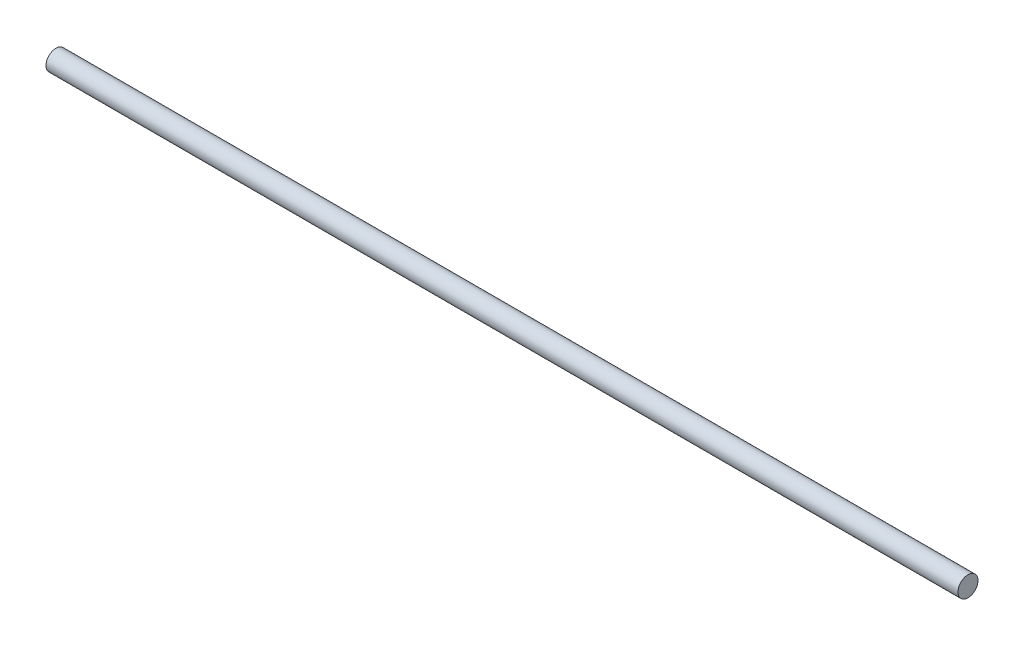
ISO-10303-21;
HEADER;
FILE_DESCRIPTION(('STEP AP214'),'2;1');
FILE_NAME('part.step','',(''),(''),'','','');
FILE_SCHEMA(('AUTOMOTIVE_DESIGN { 1 0 10303 214 1 1 1 1 }'));
ENDSEC;
DATA;
#1=APPLICATION_CONTEXT('core data for automotive mechanical design processes');
#2=APPLICATION_PROTOCOL_DEFINITION('international standard','automotive_design',2000,#1);
#3=PRODUCT_CONTEXT('',#1,'mechanical');
#4=PRODUCT('Part','Part','',(#3));
#5=PRODUCT_RELATED_PRODUCT_CATEGORY('part','',(#4));
#6=PRODUCT_DEFINITION_FORMATION('','',#4);
#7=PRODUCT_DEFINITION_CONTEXT('part definition',#1,'design');
#8=PRODUCT_DEFINITION('design','',#6,#7);
#9=PRODUCT_DEFINITION_SHAPE('','',#8);
#10=(LENGTH_UNIT() NAMED_UNIT(*) SI_UNIT(.MILLI.,.METRE.));
#11=(NAMED_UNIT(*) PLANE_ANGLE_UNIT() SI_UNIT($,.RADIAN.));
#12=(NAMED_UNIT(*) SI_UNIT($,.STERADIAN.) SOLID_ANGLE_UNIT());
#13=UNCERTAINTY_MEASURE_WITH_UNIT(LENGTH_MEASURE(1.E-05),#10,'distance_accuracy_value','');
#14=(GEOMETRIC_REPRESENTATION_CONTEXT(3) GLOBAL_UNCERTAINTY_ASSIGNED_CONTEXT((#13)) GLOBAL_UNIT_ASSIGNED_CONTEXT((#10,
#11,#12)) REPRESENTATION_CONTEXT('',''));
#15=CARTESIAN_POINT('',(0.,0.,0.));
#16=DIRECTION('',(0.,0.,1.));
#17=DIRECTION('',(1.,0.,0.));
#18=AXIS2_PLACEMENT_3D('',#15,#16,#17);
#19=CARTESIAN_POINT('',(72.3011,0.,0.));
#20=DIRECTION('',(-1.,0.,0.));
#21=DIRECTION('',(0.,0.,1.));
#22=AXIS2_PLACEMENT_3D('',#19,#20,#21);
#23=CYLINDRICAL_SURFACE('',#22,1.5875);
#24=CARTESIAN_POINT('',(72.3011,0.,0.));
#25=DIRECTION('',(1.,0.,0.));
#26=DIRECTION('',(0.,0.,-1.));
#27=AXIS2_PLACEMENT_3D('',#24,#25,#26);
#28=CIRCLE('',#27,1.5875);
#29=CARTESIAN_POINT('',(72.3011,0.,-1.5875));
#30=VERTEX_POINT('',#29);
#31=EDGE_CURVE('E10',#30,#30,#28,.T.);
#32=ORIENTED_EDGE('',*,*,#31,.F.);
#33=EDGE_LOOP('',(#32));
#34=FACE_BOUND('',#33,.T.);
#35=CARTESIAN_POINT('',(-72.3011,0.,0.));
#36=DIRECTION('',(1.,0.,0.));
#37=DIRECTION('',(0.,0.,-1.));
#38=AXIS2_PLACEMENT_3D('',#35,#36,#37);
#39=CIRCLE('',#38,1.5875);
#40=CARTESIAN_POINT('',(-72.3011,0.,-1.5875));
#41=VERTEX_POINT('',#40);
#42=EDGE_CURVE('E40',#41,#41,#39,.T.);
#43=ORIENTED_EDGE('',*,*,#42,.T.);
#44=EDGE_LOOP('',(#43));
#45=FACE_BOUND('',#44,.T.);
#46=ADVANCED_FACE('F37',(#34,#45),#23,.T.);
#47=CARTESIAN_POINT('',(72.3011,0.,0.));
#48=DIRECTION('',(1.,0.,0.));
#49=DIRECTION('',(0.,0.,-1.));
#50=AXIS2_PLACEMENT_3D('',#47,#48,#49);
#51=PLANE('',#50);
#52=ORIENTED_EDGE('',*,*,#31,.T.);
#53=EDGE_LOOP('',(#52));
#54=FACE_BOUND('',#53,.T.);
#55=ADVANCED_FACE('F54',(#54),#51,.T.);
#56=CARTESIAN_POINT('',(-72.3011,0.,0.));
#57=DIRECTION('',(1.,0.,0.));
#58=DIRECTION('',(0.,0.,-1.));
#59=AXIS2_PLACEMENT_3D('',#56,#57,#58);
#60=PLANE('',#59);
#61=ORIENTED_EDGE('',*,*,#42,.F.);
#62=EDGE_LOOP('',(#61));
#63=FACE_BOUND('',#62,.T.);
#64=ADVANCED_FACE('F52',(#63),#60,.F.);
#65=CLOSED_SHELL('',(#46,#55,#64));
#66=MANIFOLD_SOLID_BREP('B2',#65);
#67=ADVANCED_BREP_SHAPE_REPRESENTATION('',(#18,#66),#14);
#68=SHAPE_DEFINITION_REPRESENTATION(#9,#67);
ENDSEC;
END-ISO-10303-21;
